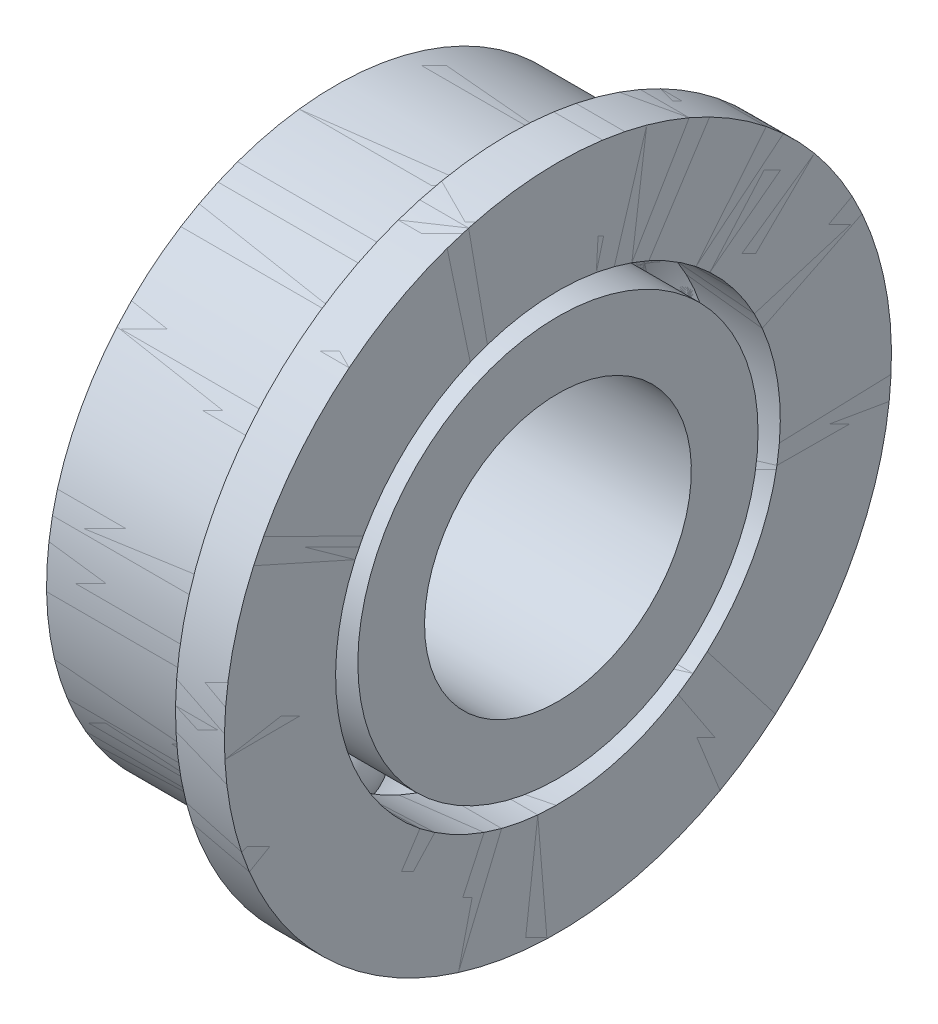
ISO-10303-21;
HEADER;
FILE_DESCRIPTION(('STEP AP214'),'2;1');
FILE_NAME('part.step','',(''),(''),'','','');
FILE_SCHEMA(('AUTOMOTIVE_DESIGN { 1 0 10303 214 1 1 1 1 }'));
ENDSEC;
DATA;
#1=APPLICATION_CONTEXT('core data for automotive mechanical design processes');
#2=APPLICATION_PROTOCOL_DEFINITION('international standard','automotive_design',2000,#1);
#3=PRODUCT_CONTEXT('',#1,'mechanical');
#4=PRODUCT('Part','Part','',(#3));
#5=PRODUCT_RELATED_PRODUCT_CATEGORY('part','',(#4));
#6=PRODUCT_DEFINITION_FORMATION('','',#4);
#7=PRODUCT_DEFINITION_CONTEXT('part definition',#1,'design');
#8=PRODUCT_DEFINITION('design','',#6,#7);
#9=PRODUCT_DEFINITION_SHAPE('','',#8);
#10=(LENGTH_UNIT() NAMED_UNIT(*) SI_UNIT(.MILLI.,.METRE.));
#11=(NAMED_UNIT(*) PLANE_ANGLE_UNIT() SI_UNIT($,.RADIAN.));
#12=(NAMED_UNIT(*) SI_UNIT($,.STERADIAN.) SOLID_ANGLE_UNIT());
#13=UNCERTAINTY_MEASURE_WITH_UNIT(LENGTH_MEASURE(1.E-05),#10,'distance_accuracy_value','');
#14=(GEOMETRIC_REPRESENTATION_CONTEXT(3) GLOBAL_UNCERTAINTY_ASSIGNED_CONTEXT((#13)) GLOBAL_UNIT_ASSIGNED_CONTEXT((#10,
#11,#12)) REPRESENTATION_CONTEXT('',''));
#15=CARTESIAN_POINT('',(0.,0.,0.));
#16=DIRECTION('',(0.,0.,1.));
#17=DIRECTION('',(1.,0.,0.));
#18=AXIS2_PLACEMENT_3D('',#15,#16,#17);
#19=CARTESIAN_POINT('',(-6.31921866442244,1.01574626800903,-15.2392354205598));
#20=DIRECTION('',(0.433227243676551,-0.012539546794911,0.901197489511925));
#21=DIRECTION('',(0.84392832847606,-0.345359327461976,-0.410502023540219));
#22=AXIS2_PLACEMENT_3D('',#19,#20,#21);
#23=SPHERICAL_SURFACE('',#22,1.);
#24=CARTESIAN_POINT('',(-5.88599142074589,1.00320672121412,-14.3380379310479));
#25=VERTEX_POINT('',#24);
#26=VERTEX_LOOP('',#25);
#27=FACE_BOUND('',#26,.T.);
#28=ADVANCED_FACE('P0_F12',(#27),#23,.T.);
#29=CLOSED_SHELL('',(#28));
#30=MANIFOLD_SOLID_BREP('P0_B1',#29);
#31=CARTESIAN_POINT('',(-6.31921866442243,-2.88926502988642,-12.5349080063385));
#32=DIRECTION('',(0.433227243676549,0.774190146346634,0.461458310832298));
#33=DIRECTION('',(0.843928328476061,-0.528184844421734,0.0938389392458731));
#34=AXIS2_PLACEMENT_3D('',#31,#32,#33);
#35=SPHERICAL_SURFACE('',#34,1.);
#36=CARTESIAN_POINT('',(-5.88599142074588,-2.11507488353978,-12.0734496955062));
#37=VERTEX_POINT('',#36);
#38=VERTEX_LOOP('',#37);
#39=FACE_BOUND('',#38,.T.);
#40=ADVANCED_FACE('P1_F12',(#39),#35,.T.);
#41=CLOSED_SHELL('',(#40));
#42=MANIFOLD_SOLID_BREP('P1_B1',#41);
#43=CARTESIAN_POINT('',(-6.31921866442242,-2.49975443796778,-7.80090531318512));
#44=DIRECTION('',(0.433227243676548,0.786729693141543,-0.439739178679629));
#45=DIRECTION('',(0.84392832847606,-0.182825516959753,0.504340962786091));
#46=AXIS2_PLACEMENT_3D('',#43,#44,#45);
#47=SPHERICAL_SURFACE('',#46,1.);
#48=CARTESIAN_POINT('',(-5.88599142074588,-1.71302474482624,-8.24064449186475));
#49=VERTEX_POINT('',#48);
#50=VERTEX_LOOP('',#49);
#51=FACE_BOUND('',#50,.T.);
#52=ADVANCED_FACE('P2_F12',(#51),#47,.T.);
#53=CLOSED_SHELL('',(#52));
#54=MANIFOLD_SOLID_BREP('P2_B1',#53);
#55=CARTESIAN_POINT('',(-6.31921866442243,1.79476745184631,-5.77123003425311));
#56=DIRECTION('',(0.433227243676549,0.0125395467949068,-0.901197489511926));
#57=DIRECTION('',(0.843928328476059,0.345359327461983,0.410502023540215));
#58=AXIS2_PLACEMENT_3D('',#55,#56,#57);
#59=SPHERICAL_SURFACE('',#58,1.);
#60=CARTESIAN_POINT('',(-5.88599142074588,1.80730699864121,-6.67242752376503));
#61=VERTEX_POINT('',#60);
#62=VERTEX_LOOP('',#61);
#63=FACE_BOUND('',#62,.T.);
#64=ADVANCED_FACE('P3_F12',(#63),#59,.T.);
#65=CLOSED_SHELL('',(#64));
#66=MANIFOLD_SOLID_BREP('P3_B1',#65);
#67=CARTESIAN_POINT('',(-6.31921866442244,5.69977874974173,-8.47555744847446));
#68=DIRECTION('',(0.433227243676551,-0.774190146346635,-0.461458310832294));
#69=DIRECTION('',(0.843928328476059,0.528184844421737,-0.0938389392458785));
#70=AXIS2_PLACEMENT_3D('',#67,#68,#69);
#71=SPHERICAL_SURFACE('',#70,1.);
#72=CARTESIAN_POINT('',(-5.88599142074589,4.9255886033951,-8.93701575930676));
#73=VERTEX_POINT('',#72);
#74=VERTEX_LOOP('',#73);
#75=FACE_BOUND('',#74,.T.);
#76=ADVANCED_FACE('P4_F12',(#75),#71,.T.);
#77=CLOSED_SHELL('',(#76));
#78=MANIFOLD_SOLID_BREP('P4_B1',#77);
#79=CARTESIAN_POINT('',(-6.31921866442245,5.31026815782306,-13.2095601416278));
#80=DIRECTION('',(0.433227243676552,-0.786729693141538,0.439739178679634));
#81=DIRECTION('',(0.843928328476059,0.182825516959754,-0.504340962786094));
#82=AXIS2_PLACEMENT_3D('',#79,#80,#81);
#83=SPHERICAL_SURFACE('',#82,1.);
#84=CARTESIAN_POINT('',(-5.88599142074589,4.52353846468152,-12.7698209629482));
#85=VERTEX_POINT('',#84);
#86=VERTEX_LOOP('',#85);
#87=FACE_BOUND('',#86,.T.);
#88=ADVANCED_FACE('P5_F12',(#87),#83,.T.);
#89=CLOSED_SHELL('',(#88));
#90=MANIFOLD_SOLID_BREP('P5_B1',#89);
#91=CARTESIAN_POINT('',(-6.31921866442243,1.40525685992765,-10.5052327274065));
#92=DIRECTION('',(-1.,0.,0.));
#93=DIRECTION('',(0.,0.704633641262034,-0.709571301281138));
#94=AXIS2_PLACEMENT_3D('',#91,#92,#93);
#95=CYLINDRICAL_SURFACE('',#94,4.5);
#96=CARTESIAN_POINT('',(-8.81921866442243,1.40525685992764,-10.5052327274065));
#97=DIRECTION('',(-1.,0.,0.));
#98=DIRECTION('',(0.,0.704633641262034,-0.709571301281138));
#99=AXIS2_PLACEMENT_3D('',#96,#97,#98);
#100=CIRCLE('',#99,4.5);
#101=CARTESIAN_POINT('',(-8.81921866442244,4.5761082456068,-13.6983035831716));
#102=VERTEX_POINT('',#101);
#103=EDGE_CURVE('P6_E10',#102,#102,#100,.T.);
#104=ORIENTED_EDGE('',*,*,#103,.F.);
#105=EDGE_LOOP('',(#104));
#106=FACE_BOUND('',#105,.T.);
#107=CARTESIAN_POINT('',(-7.28746450097429,1.40525685992765,-10.5052327274065));
#108=DIRECTION('',(-1.,0.,0.));
#109=DIRECTION('',(0.,0.704633641262034,-0.709571301281138));
#110=AXIS2_PLACEMENT_3D('',#107,#108,#109);
#111=CIRCLE('',#110,4.5);
#112=CARTESIAN_POINT('',(-7.2874645009743,4.5761082456068,-13.6983035831716));
#113=VERTEX_POINT('',#112);
#114=EDGE_CURVE('P6_E36',#113,#113,#111,.T.);
#115=ORIENTED_EDGE('',*,*,#114,.T.);
#116=EDGE_LOOP('',(#115));
#117=FACE_BOUND('',#116,.T.);
#118=ADVANCED_FACE('P6_F14',(#106,#117),#95,.T.);
#119=CARTESIAN_POINT('',(-8.81921866442243,-1.78781399583748,-13.6760841130856));
#120=DIRECTION('',(1.,0.,0.));
#121=DIRECTION('',(0.,-0.704633641262034,0.709571301281138));
#122=AXIS2_PLACEMENT_3D('',#119,#120,#121);
#123=PLANE('',#122);
#124=CARTESIAN_POINT('',(-8.81921866442243,1.40525685992764,-10.5052327274065));
#125=DIRECTION('',(-1.,0.,0.));
#126=DIRECTION('',(0.,0.704633641262034,-0.709571301281138));
#127=AXIS2_PLACEMENT_3D('',#124,#125,#126);
#128=CIRCLE('',#127,3.);
#129=CARTESIAN_POINT('',(-8.81921866442244,3.51915778371375,-12.6339466312499));
#130=VERTEX_POINT('',#129);
#131=EDGE_CURVE('P6_E20',#130,#130,#128,.T.);
#132=ORIENTED_EDGE('',*,*,#131,.F.);
#133=EDGE_LOOP('',(#132));
#134=FACE_BOUND('',#133,.T.);
#135=ORIENTED_EDGE('',*,*,#103,.T.);
#136=EDGE_LOOP('',(#135));
#137=FACE_BOUND('',#136,.T.);
#138=ADVANCED_FACE('P6_F61',(#134,#137),#123,.F.);
#139=CARTESIAN_POINT('',(-6.31921866442243,1.40525685992765,-10.5052327274065));
#140=DIRECTION('',(-1.,0.,0.));
#141=DIRECTION('',(0.,0.704633641262034,-0.709571301281138));
#142=AXIS2_PLACEMENT_3D('',#139,#140,#141);
#143=CYLINDRICAL_SURFACE('',#142,3.);
#144=CARTESIAN_POINT('',(-3.81921866442243,1.40525685992766,-10.5052327274065));
#145=DIRECTION('',(-1.,0.,0.));
#146=DIRECTION('',(0.,0.704633641262034,-0.709571301281138));
#147=AXIS2_PLACEMENT_3D('',#144,#145,#146);
#148=CIRCLE('',#147,3.);
#149=CARTESIAN_POINT('',(-3.81921866442244,3.51915778371376,-12.6339466312499));
#150=VERTEX_POINT('',#149);
#151=EDGE_CURVE('P6_E24',#150,#150,#148,.T.);
#152=ORIENTED_EDGE('',*,*,#151,.F.);
#153=EDGE_LOOP('',(#152));
#154=FACE_BOUND('',#153,.T.);
#155=ORIENTED_EDGE('',*,*,#131,.T.);
#156=EDGE_LOOP('',(#155));
#157=FACE_BOUND('',#156,.T.);
#158=ADVANCED_FACE('P6_F56',(#154,#157),#143,.F.);
#159=CARTESIAN_POINT('',(-3.81921866442243,-1.78781399583747,-13.6760841130856));
#160=DIRECTION('',(-1.,0.,0.));
#161=DIRECTION('',(0.,0.704633641262034,-0.709571301281138));
#162=AXIS2_PLACEMENT_3D('',#159,#160,#161);
#163=PLANE('',#162);
#164=CARTESIAN_POINT('',(-3.81921866442243,1.40525685992766,-10.5052327274065));
#165=DIRECTION('',(-1.,0.,0.));
#166=DIRECTION('',(0.,0.704633641262034,-0.709571301281138));
#167=AXIS2_PLACEMENT_3D('',#164,#165,#166);
#168=CIRCLE('',#167,4.5);
#169=CARTESIAN_POINT('',(-3.81921866442244,4.57610824560681,-13.6983035831716));
#170=VERTEX_POINT('',#169);
#171=EDGE_CURVE('P6_E28',#170,#170,#168,.T.);
#172=ORIENTED_EDGE('',*,*,#171,.F.);
#173=EDGE_LOOP('',(#172));
#174=FACE_BOUND('',#173,.T.);
#175=ORIENTED_EDGE('',*,*,#151,.T.);
#176=EDGE_LOOP('',(#175));
#177=FACE_BOUND('',#176,.T.);
#178=ADVANCED_FACE('P6_F50',(#174,#177),#163,.F.);
#179=CARTESIAN_POINT('',(-6.31921866442243,1.40525685992765,-10.5052327274065));
#180=DIRECTION('',(-1.,0.,0.));
#181=DIRECTION('',(0.,0.704633641262034,-0.709571301281138));
#182=AXIS2_PLACEMENT_3D('',#179,#180,#181);
#183=CYLINDRICAL_SURFACE('',#182,4.5);
#184=CARTESIAN_POINT('',(-5.35097282787058,1.40525685992765,-10.5052327274065));
#185=DIRECTION('',(-1.,0.,0.));
#186=DIRECTION('',(0.,0.704633641262034,-0.709571301281138));
#187=AXIS2_PLACEMENT_3D('',#184,#185,#186);
#188=CIRCLE('',#187,4.5);
#189=CARTESIAN_POINT('',(-5.35097282787059,4.5761082456068,-13.6983035831716));
#190=VERTEX_POINT('',#189);
#191=EDGE_CURVE('P6_E33',#190,#190,#188,.T.);
#192=ORIENTED_EDGE('',*,*,#191,.F.);
#193=EDGE_LOOP('',(#192));
#194=FACE_BOUND('',#193,.T.);
#195=ORIENTED_EDGE('',*,*,#171,.T.);
#196=EDGE_LOOP('',(#195));
#197=FACE_BOUND('',#196,.T.);
#198=ADVANCED_FACE('P6_F44',(#194,#197),#183,.T.);
#199=CARTESIAN_POINT('',(-6.31921866442243,1.40525685992765,-10.5052327274065));
#200=DIRECTION('',(-1.,0.,0.));
#201=DIRECTION('',(0.,0.704633641262034,-0.709571301281138));
#202=AXIS2_PLACEMENT_3D('',#199,#200,#201);
#203=TOROIDAL_SURFACE('',#202,4.75,1.);
#204=ORIENTED_EDGE('',*,*,#114,.F.);
#205=EDGE_LOOP('',(#204));
#206=FACE_BOUND('',#205,.T.);
#207=ORIENTED_EDGE('',*,*,#191,.T.);
#208=EDGE_LOOP('',(#207));
#209=FACE_BOUND('',#208,.T.);
#210=ADVANCED_FACE('P6_F41',(#206,#209),#203,.F.);
#211=CLOSED_SHELL('',(#118,#138,#158,#178,#198,#210));
#212=MANIFOLD_SOLID_BREP('P6_B1',#211);
#213=CARTESIAN_POINT('',(-8.81921866442244,7.33653215754657,-13.164174874926));
#214=DIRECTION('',(1.,0.,0.));
#215=DIRECTION('',(0.,-0.409068022695307,-0.912503891941372));
#216=AXIS2_PLACEMENT_3D('',#213,#214,#215);
#217=PLANE('',#216);
#218=CARTESIAN_POINT('',(-8.81921866442244,1.40525685992765,-10.5052327274065));
#219=DIRECTION('',(-1.,0.,0.));
#220=DIRECTION('',(0.,0.409068022695307,0.912503891941372));
#221=AXIS2_PLACEMENT_3D('',#218,#219,#220);
#222=CIRCLE('',#221,5.);
#223=CARTESIAN_POINT('',(-8.81921866442244,3.45059697340418,-5.9427132676996));
#224=VERTEX_POINT('',#223);
#225=EDGE_CURVE('P7_E10',#224,#224,#222,.T.);
#226=ORIENTED_EDGE('',*,*,#225,.F.);
#227=EDGE_LOOP('',(#226));
#228=FACE_BOUND('',#227,.T.);
#229=CARTESIAN_POINT('',(-8.81921866442244,1.40525685992765,-10.5052327274065));
#230=DIRECTION('',(-1.,0.,0.));
#231=DIRECTION('',(0.,0.409068022695307,0.912503891941372));
#232=AXIS2_PLACEMENT_3D('',#229,#230,#231);
#233=CIRCLE('',#232,6.5);
#234=CARTESIAN_POINT('',(-8.81921866442244,4.06419900744715,-4.57395742978754));
#235=VERTEX_POINT('',#234);
#236=EDGE_CURVE('P7_E42',#235,#235,#233,.T.);
#237=ORIENTED_EDGE('',*,*,#236,.T.);
#238=EDGE_LOOP('',(#237));
#239=FACE_BOUND('',#238,.T.);
#240=ADVANCED_FACE('P7_F14',(#228,#239),#217,.F.);
#241=CARTESIAN_POINT('',(-6.31921866442244,1.40525685992765,-10.5052327274065));
#242=DIRECTION('',(-1.,0.,0.));
#243=DIRECTION('',(0.,0.409068022695307,0.912503891941372));
#244=AXIS2_PLACEMENT_3D('',#241,#242,#243);
#245=CYLINDRICAL_SURFACE('',#244,5.);
#246=CARTESIAN_POINT('',(-7.2874645009743,1.40525685992765,-10.5052327274065));
#247=DIRECTION('',(-1.,0.,0.));
#248=DIRECTION('',(0.,0.409068022695307,0.912503891941372));
#249=AXIS2_PLACEMENT_3D('',#246,#247,#248);
#250=CIRCLE('',#249,5.);
#251=CARTESIAN_POINT('',(-7.2874645009743,3.45059697340419,-5.9427132676996));
#252=VERTEX_POINT('',#251);
#253=EDGE_CURVE('P7_E20',#252,#252,#250,.T.);
#254=ORIENTED_EDGE('',*,*,#253,.F.);
#255=EDGE_LOOP('',(#254));
#256=FACE_BOUND('',#255,.T.);
#257=ORIENTED_EDGE('',*,*,#225,.T.);
#258=EDGE_LOOP('',(#257));
#259=FACE_BOUND('',#258,.T.);
#260=ADVANCED_FACE('P7_F79',(#256,#259),#245,.F.);
#261=CARTESIAN_POINT('',(-6.31921866442244,1.40525685992765,-10.5052327274065));
#262=DIRECTION('',(-1.,0.,0.));
#263=DIRECTION('',(0.,0.409068022695307,0.912503891941372));
#264=AXIS2_PLACEMENT_3D('',#261,#262,#263);
#265=TOROIDAL_SURFACE('',#264,4.75,1.);
#266=CARTESIAN_POINT('',(-5.35097282787059,1.40525685992765,-10.5052327274065));
#267=DIRECTION('',(-1.,0.,0.));
#268=DIRECTION('',(0.,0.409068022695307,0.912503891941372));
#269=AXIS2_PLACEMENT_3D('',#266,#267,#268);
#270=CIRCLE('',#269,5.);
#271=CARTESIAN_POINT('',(-5.35097282787059,3.45059697340419,-5.9427132676996));
#272=VERTEX_POINT('',#271);
#273=EDGE_CURVE('P7_E24',#272,#272,#270,.T.);
#274=ORIENTED_EDGE('',*,*,#273,.F.);
#275=EDGE_LOOP('',(#274));
#276=FACE_BOUND('',#275,.T.);
#277=ORIENTED_EDGE('',*,*,#253,.T.);
#278=EDGE_LOOP('',(#277));
#279=FACE_BOUND('',#278,.T.);
#280=ADVANCED_FACE('P7_F74',(#276,#279),#265,.F.);
#281=CARTESIAN_POINT('',(-6.31921866442244,1.40525685992765,-10.5052327274065));
#282=DIRECTION('',(-1.,0.,0.));
#283=DIRECTION('',(0.,0.409068022695307,0.912503891941372));
#284=AXIS2_PLACEMENT_3D('',#281,#282,#283);
#285=CYLINDRICAL_SURFACE('',#284,5.);
#286=CARTESIAN_POINT('',(-3.81921866442244,1.40525685992765,-10.5052327274065));
#287=DIRECTION('',(-1.,0.,0.));
#288=DIRECTION('',(0.,0.409068022695307,0.912503891941372));
#289=AXIS2_PLACEMENT_3D('',#286,#287,#288);
#290=CIRCLE('',#289,5.);
#291=CARTESIAN_POINT('',(-3.81921866442244,3.45059697340419,-5.9427132676996));
#292=VERTEX_POINT('',#291);
#293=EDGE_CURVE('P7_E28',#292,#292,#290,.T.);
#294=ORIENTED_EDGE('',*,*,#293,.F.);
#295=EDGE_LOOP('',(#294));
#296=FACE_BOUND('',#295,.T.);
#297=ORIENTED_EDGE('',*,*,#273,.T.);
#298=EDGE_LOOP('',(#297));
#299=FACE_BOUND('',#298,.T.);
#300=ADVANCED_FACE('P7_F68',(#296,#299),#285,.F.);
#301=CARTESIAN_POINT('',(-3.81921866442244,7.33653215754657,-13.164174874926));
#302=DIRECTION('',(-1.,0.,0.));
#303=DIRECTION('',(0.,0.409068022695307,0.912503891941372));
#304=AXIS2_PLACEMENT_3D('',#301,#302,#303);
#305=PLANE('',#304);
#306=CARTESIAN_POINT('',(-3.81921866442244,1.40525685992765,-10.5052327274065));
#307=DIRECTION('',(-1.,0.,0.));
#308=DIRECTION('',(0.,0.409068022695307,0.912503891941372));
#309=AXIS2_PLACEMENT_3D('',#306,#307,#308);
#310=CIRCLE('',#309,7.5);
#311=CARTESIAN_POINT('',(-3.81921866442244,4.47326703014245,-3.66145353784617));
#312=VERTEX_POINT('',#311);
#313=EDGE_CURVE('P7_E33',#312,#312,#310,.T.);
#314=ORIENTED_EDGE('',*,*,#313,.F.);
#315=EDGE_LOOP('',(#314));
#316=FACE_BOUND('',#315,.T.);
#317=ORIENTED_EDGE('',*,*,#293,.T.);
#318=EDGE_LOOP('',(#317));
#319=FACE_BOUND('',#318,.T.);
#320=ADVANCED_FACE('P7_F62',(#316,#319),#305,.F.);
#321=CARTESIAN_POINT('',(-6.31921866442244,1.40525685992765,-10.5052327274065));
#322=DIRECTION('',(-1.,0.,0.));
#323=DIRECTION('',(0.,0.409068022695307,0.912503891941372));
#324=AXIS2_PLACEMENT_3D('',#321,#322,#323);
#325=CYLINDRICAL_SURFACE('',#324,7.5);
#326=CARTESIAN_POINT('',(-4.91921866442244,1.40525685992765,-10.5052327274065));
#327=DIRECTION('',(-1.,0.,0.));
#328=DIRECTION('',(0.,0.409068022695307,0.912503891941372));
#329=AXIS2_PLACEMENT_3D('',#326,#327,#328);
#330=CIRCLE('',#329,7.5);
#331=CARTESIAN_POINT('',(-4.91921866442244,4.47326703014245,-3.66145353784617));
#332=VERTEX_POINT('',#331);
#333=EDGE_CURVE('P7_E36',#332,#332,#330,.T.);
#334=ORIENTED_EDGE('',*,*,#333,.F.);
#335=EDGE_LOOP('',(#334));
#336=FACE_BOUND('',#335,.T.);
#337=ORIENTED_EDGE('',*,*,#313,.T.);
#338=EDGE_LOOP('',(#337));
#339=FACE_BOUND('',#338,.T.);
#340=ADVANCED_FACE('P7_F56',(#336,#339),#325,.T.);
#341=CARTESIAN_POINT('',(-4.91921866442244,8.24903604948794,-13.5732428976213));
#342=DIRECTION('',(1.,0.,0.));
#343=DIRECTION('',(0.,-0.409068022695307,-0.912503891941372));
#344=AXIS2_PLACEMENT_3D('',#341,#342,#343);
#345=PLANE('',#344);
#346=CARTESIAN_POINT('',(-4.91921866442244,1.40525685992765,-10.5052327274065));
#347=DIRECTION('',(-1.,0.,0.));
#348=DIRECTION('',(0.,0.409068022695307,0.912503891941372));
#349=AXIS2_PLACEMENT_3D('',#346,#347,#348);
#350=CIRCLE('',#349,6.5);
#351=CARTESIAN_POINT('',(-4.91921866442244,4.06419900744715,-4.57395742978754));
#352=VERTEX_POINT('',#351);
#353=EDGE_CURVE('P7_E39',#352,#352,#350,.T.);
#354=ORIENTED_EDGE('',*,*,#353,.F.);
#355=EDGE_LOOP('',(#354));
#356=FACE_BOUND('',#355,.T.);
#357=ORIENTED_EDGE('',*,*,#333,.T.);
#358=EDGE_LOOP('',(#357));
#359=FACE_BOUND('',#358,.T.);
#360=ADVANCED_FACE('P7_F50',(#356,#359),#345,.F.);
#361=CARTESIAN_POINT('',(-6.31921866442244,1.40525685992765,-10.5052327274065));
#362=DIRECTION('',(-1.,0.,0.));
#363=DIRECTION('',(0.,0.409068022695307,0.912503891941372));
#364=AXIS2_PLACEMENT_3D('',#361,#362,#363);
#365=CYLINDRICAL_SURFACE('',#364,6.5);
#366=ORIENTED_EDGE('',*,*,#236,.F.);
#367=EDGE_LOOP('',(#366));
#368=FACE_BOUND('',#367,.T.);
#369=ORIENTED_EDGE('',*,*,#353,.T.);
#370=EDGE_LOOP('',(#369));
#371=FACE_BOUND('',#370,.T.);
#372=ADVANCED_FACE('P7_F47',(#368,#371),#365,.T.);
#373=CLOSED_SHELL('',(#240,#260,#280,#300,#320,#340,#360,#372));
#374=MANIFOLD_SOLID_BREP('P7_B1',#373);
#375=CARTESIAN_POINT('',(-6.31921866442244,1.40525685992765,-10.5052327274065));
#376=DIRECTION('',(-1.,0.,0.));
#377=DIRECTION('',(0.,0.409068022695307,0.912503891941372));
#378=AXIS2_PLACEMENT_3D('',#375,#376,#377);
#379=TOROIDAL_SURFACE('',#378,4.75,1.);
#380=CARTESIAN_POINT('',(-7.2874645009743,1.40525685992765,-10.5052327274065));
#381=DIRECTION('',(-1.,0.,0.));
#382=DIRECTION('',(0.,0.409068022695307,0.912503891941372));
#383=AXIS2_PLACEMENT_3D('',#380,#381,#382);
#384=CIRCLE('',#383,5.);
#385=CARTESIAN_POINT('',(-7.2874645009743,3.45059697340419,-5.9427132676996));
#386=VERTEX_POINT('',#385);
#387=EDGE_CURVE('P8_E42',#386,#386,#384,.T.);
#388=ORIENTED_EDGE('',*,*,#387,.T.);
#389=EDGE_LOOP('',(#388));
#390=FACE_BOUND('',#389,.T.);
#391=CARTESIAN_POINT('',(-5.35097282787059,1.40525685992765,-10.5052327274065));
#392=DIRECTION('',(-1.,0.,0.));
#393=DIRECTION('',(0.,0.409068022695307,0.912503891941372));
#394=AXIS2_PLACEMENT_3D('',#391,#392,#393);
#395=CIRCLE('',#394,5.);
#396=CARTESIAN_POINT('',(-5.35097282787059,3.45059697340419,-5.9427132676996));
#397=VERTEX_POINT('',#396);
#398=EDGE_CURVE('P8_E10',#397,#397,#395,.T.);
#399=ORIENTED_EDGE('',*,*,#398,.F.);
#400=EDGE_LOOP('',(#399));
#401=FACE_BOUND('',#400,.T.);
#402=ADVANCED_FACE('P8_F14',(#390,#401),#379,.F.);
#403=CARTESIAN_POINT('',(-6.31921866442244,1.40525685992765,-10.5052327274065));
#404=DIRECTION('',(-1.,0.,0.));
#405=DIRECTION('',(0.,0.409068022695307,0.912503891941372));
#406=AXIS2_PLACEMENT_3D('',#403,#404,#405);
#407=CYLINDRICAL_SURFACE('',#406,5.);
#408=ORIENTED_EDGE('',*,*,#398,.T.);
#409=EDGE_LOOP('',(#408));
#410=FACE_BOUND('',#409,.T.);
#411=CARTESIAN_POINT('',(-3.81921866442244,1.40525685992765,-10.5052327274065));
#412=DIRECTION('',(-1.,0.,0.));
#413=DIRECTION('',(0.,0.409068022695307,0.912503891941372));
#414=AXIS2_PLACEMENT_3D('',#411,#412,#413);
#415=CIRCLE('',#414,5.);
#416=CARTESIAN_POINT('',(-3.81921866442244,3.45059697340419,-5.9427132676996));
#417=VERTEX_POINT('',#416);
#418=EDGE_CURVE('P8_E20',#417,#417,#415,.T.);
#419=ORIENTED_EDGE('',*,*,#418,.F.);
#420=EDGE_LOOP('',(#419));
#421=FACE_BOUND('',#420,.T.);
#422=ADVANCED_FACE('P8_F61',(#410,#421),#407,.F.);
#423=CARTESIAN_POINT('',(-3.81921866442244,-4.52601843769127,-7.84629057988696));
#424=DIRECTION('',(1.,0.,0.));
#425=DIRECTION('',(0.,-0.409068022695307,-0.912503891941372));
#426=AXIS2_PLACEMENT_3D('',#423,#424,#425);
#427=PLANE('',#426);
#428=ORIENTED_EDGE('',*,*,#418,.T.);
#429=EDGE_LOOP('',(#428));
#430=FACE_BOUND('',#429,.T.);
#431=CARTESIAN_POINT('',(-3.81921866442244,1.40525685992765,-10.5052327274065));
#432=DIRECTION('',(-1.,0.,0.));
#433=DIRECTION('',(0.,0.409068022695307,0.912503891941372));
#434=AXIS2_PLACEMENT_3D('',#431,#432,#433);
#435=CIRCLE('',#434,7.5);
#436=CARTESIAN_POINT('',(-3.81921866442244,4.47326703014245,-3.66145353784617));
#437=VERTEX_POINT('',#436);
#438=EDGE_CURVE('P8_E24',#437,#437,#435,.T.);
#439=ORIENTED_EDGE('',*,*,#438,.F.);
#440=EDGE_LOOP('',(#439));
#441=FACE_BOUND('',#440,.T.);
#442=ADVANCED_FACE('P8_F65',(#430,#441),#427,.T.);
#443=CARTESIAN_POINT('',(-6.31921866442244,1.40525685992765,-10.5052327274065));
#444=DIRECTION('',(-1.,0.,0.));
#445=DIRECTION('',(0.,0.409068022695307,0.912503891941372));
#446=AXIS2_PLACEMENT_3D('',#443,#444,#445);
#447=CYLINDRICAL_SURFACE('',#446,7.5);
#448=ORIENTED_EDGE('',*,*,#438,.T.);
#449=EDGE_LOOP('',(#448));
#450=FACE_BOUND('',#449,.T.);
#451=CARTESIAN_POINT('',(-4.91921866442244,1.40525685992765,-10.5052327274065));
#452=DIRECTION('',(-1.,0.,0.));
#453=DIRECTION('',(0.,0.409068022695307,0.912503891941372));
#454=AXIS2_PLACEMENT_3D('',#451,#452,#453);
#455=CIRCLE('',#454,7.5);
#456=CARTESIAN_POINT('',(-4.91921866442244,4.47326703014245,-3.66145353784617));
#457=VERTEX_POINT('',#456);
#458=EDGE_CURVE('P8_E28',#457,#457,#455,.T.);
#459=ORIENTED_EDGE('',*,*,#458,.F.);
#460=EDGE_LOOP('',(#459));
#461=FACE_BOUND('',#460,.T.);
#462=ADVANCED_FACE('P8_F69',(#450,#461),#447,.T.);
#463=CARTESIAN_POINT('',(-4.91921866442244,-5.43852232963264,-7.43722255719165));
#464=DIRECTION('',(-1.,0.,0.));
#465=DIRECTION('',(0.,0.409068022695307,0.912503891941372));
#466=AXIS2_PLACEMENT_3D('',#463,#464,#465);
#467=PLANE('',#466);
#468=ORIENTED_EDGE('',*,*,#458,.T.);
#469=EDGE_LOOP('',(#468));
#470=FACE_BOUND('',#469,.T.);
#471=CARTESIAN_POINT('',(-4.91921866442244,1.40525685992765,-10.5052327274065));
#472=DIRECTION('',(-1.,0.,0.));
#473=DIRECTION('',(0.,0.409068022695307,0.912503891941372));
#474=AXIS2_PLACEMENT_3D('',#471,#472,#473);
#475=CIRCLE('',#474,6.5);
#476=CARTESIAN_POINT('',(-4.91921866442244,4.06419900744715,-4.57395742978754));
#477=VERTEX_POINT('',#476);
#478=EDGE_CURVE('P8_E33',#477,#477,#475,.T.);
#479=ORIENTED_EDGE('',*,*,#478,.F.);
#480=EDGE_LOOP('',(#479));
#481=FACE_BOUND('',#480,.T.);
#482=ADVANCED_FACE('P8_F75',(#470,#481),#467,.T.);
#483=CARTESIAN_POINT('',(-6.31921866442244,1.40525685992765,-10.5052327274065));
#484=DIRECTION('',(-1.,0.,0.));
#485=DIRECTION('',(0.,0.409068022695307,0.912503891941372));
#486=AXIS2_PLACEMENT_3D('',#483,#484,#485);
#487=CYLINDRICAL_SURFACE('',#486,6.5);
#488=ORIENTED_EDGE('',*,*,#478,.T.);
#489=EDGE_LOOP('',(#488));
#490=FACE_BOUND('',#489,.T.);
#491=CARTESIAN_POINT('',(-8.81921866442244,1.40525685992765,-10.5052327274065));
#492=DIRECTION('',(-1.,0.,0.));
#493=DIRECTION('',(0.,0.409068022695307,0.912503891941372));
#494=AXIS2_PLACEMENT_3D('',#491,#492,#493);
#495=CIRCLE('',#494,6.5);
#496=CARTESIAN_POINT('',(-8.81921866442244,4.06419900744715,-4.57395742978754));
#497=VERTEX_POINT('',#496);
#498=EDGE_CURVE('P8_E36',#497,#497,#495,.T.);
#499=ORIENTED_EDGE('',*,*,#498,.F.);
#500=EDGE_LOOP('',(#499));
#501=FACE_BOUND('',#500,.T.);
#502=ADVANCED_FACE('P8_F57',(#490,#501),#487,.T.);
#503=CARTESIAN_POINT('',(-8.81921866442244,-4.52601843769127,-7.84629057988696));
#504=DIRECTION('',(-1.,0.,0.));
#505=DIRECTION('',(0.,0.409068022695307,0.912503891941372));
#506=AXIS2_PLACEMENT_3D('',#503,#504,#505);
#507=PLANE('',#506);
#508=ORIENTED_EDGE('',*,*,#498,.T.);
#509=EDGE_LOOP('',(#508));
#510=FACE_BOUND('',#509,.T.);
#511=CARTESIAN_POINT('',(-8.81921866442244,1.40525685992765,-10.5052327274065));
#512=DIRECTION('',(-1.,0.,0.));
#513=DIRECTION('',(0.,0.409068022695307,0.912503891941372));
#514=AXIS2_PLACEMENT_3D('',#511,#512,#513);
#515=CIRCLE('',#514,5.);
#516=CARTESIAN_POINT('',(-8.81921866442244,3.45059697340418,-5.9427132676996));
#517=VERTEX_POINT('',#516);
#518=EDGE_CURVE('P8_E39',#517,#517,#515,.T.);
#519=ORIENTED_EDGE('',*,*,#518,.F.);
#520=EDGE_LOOP('',(#519));
#521=FACE_BOUND('',#520,.T.);
#522=ADVANCED_FACE('P8_F50',(#510,#521),#507,.T.);
#523=CARTESIAN_POINT('',(-6.31921866442244,1.40525685992765,-10.5052327274065));
#524=DIRECTION('',(-1.,0.,0.));
#525=DIRECTION('',(0.,0.409068022695307,0.912503891941372));
#526=AXIS2_PLACEMENT_3D('',#523,#524,#525);
#527=CYLINDRICAL_SURFACE('',#526,5.);
#528=ORIENTED_EDGE('',*,*,#518,.T.);
#529=EDGE_LOOP('',(#528));
#530=FACE_BOUND('',#529,.T.);
#531=ORIENTED_EDGE('',*,*,#387,.F.);
#532=EDGE_LOOP('',(#531));
#533=FACE_BOUND('',#532,.T.);
#534=ADVANCED_FACE('P8_F48',(#530,#533),#527,.F.);
#535=CLOSED_SHELL('',(#402,#422,#442,#462,#482,#502,#522,#534));
#536=MANIFOLD_SOLID_BREP('P8_B1',#535);
#537=ADVANCED_BREP_SHAPE_REPRESENTATION('',(#18,#30,#42,#54,#66,#78,#90,#212,#374,#536),#14);
#538=SHAPE_DEFINITION_REPRESENTATION(#9,#537);
ENDSEC;
END-ISO-10303-21;
